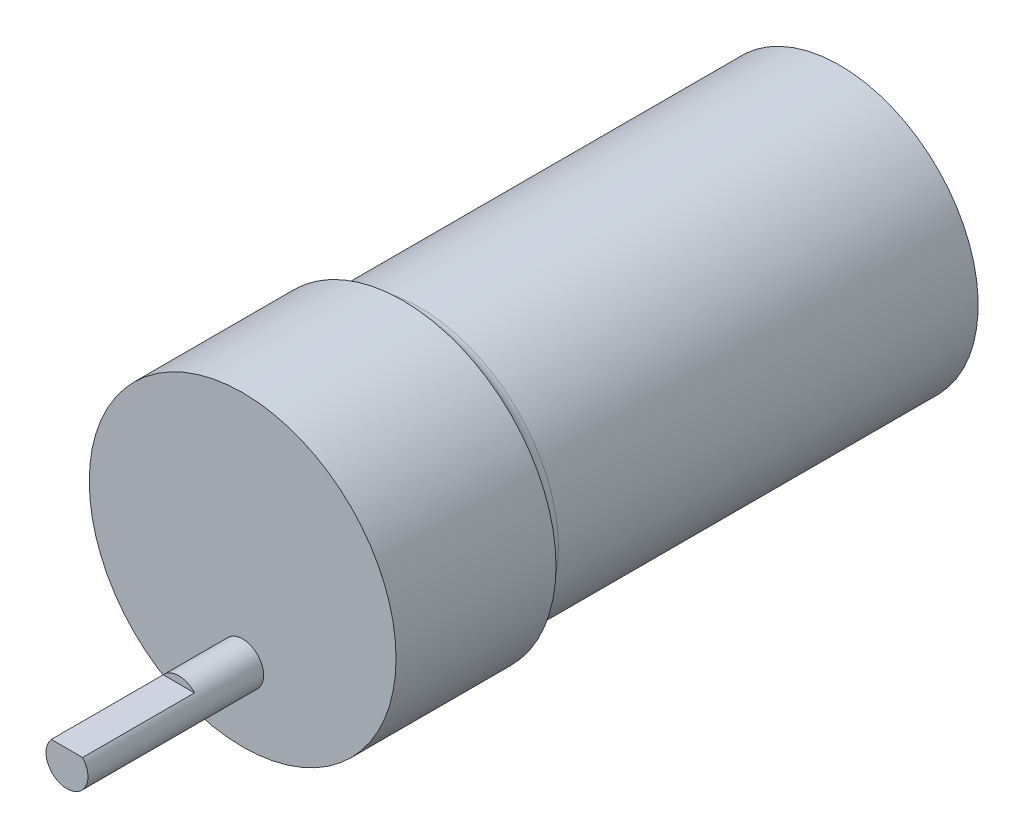
ISO-10303-21;
HEADER;
FILE_DESCRIPTION(('STEP AP214'),'2;1');
FILE_NAME('part.step','',(''),(''),'','','');
FILE_SCHEMA(('AUTOMOTIVE_DESIGN { 1 0 10303 214 1 1 1 1 }'));
ENDSEC;
DATA;
#1=APPLICATION_CONTEXT('core data for automotive mechanical design processes');
#2=APPLICATION_PROTOCOL_DEFINITION('international standard','automotive_design',2000,#1);
#3=PRODUCT_CONTEXT('',#1,'mechanical');
#4=PRODUCT('Part','Part','',(#3));
#5=PRODUCT_RELATED_PRODUCT_CATEGORY('part','',(#4));
#6=PRODUCT_DEFINITION_FORMATION('','',#4);
#7=PRODUCT_DEFINITION_CONTEXT('part definition',#1,'design');
#8=PRODUCT_DEFINITION('design','',#6,#7);
#9=PRODUCT_DEFINITION_SHAPE('','',#8);
#10=(LENGTH_UNIT() NAMED_UNIT(*) SI_UNIT(.MILLI.,.METRE.));
#11=(NAMED_UNIT(*) PLANE_ANGLE_UNIT() SI_UNIT($,.RADIAN.));
#12=(NAMED_UNIT(*) SI_UNIT($,.STERADIAN.) SOLID_ANGLE_UNIT());
#13=UNCERTAINTY_MEASURE_WITH_UNIT(LENGTH_MEASURE(1.E-05),#10,'distance_accuracy_value','');
#14=(GEOMETRIC_REPRESENTATION_CONTEXT(3) GLOBAL_UNCERTAINTY_ASSIGNED_CONTEXT((#13)) GLOBAL_UNIT_ASSIGNED_CONTEXT((#10,
#11,#12)) REPRESENTATION_CONTEXT('',''));
#15=CARTESIAN_POINT('',(0.,0.,0.));
#16=DIRECTION('',(0.,0.,1.));
#17=DIRECTION('',(1.,0.,0.));
#18=AXIS2_PLACEMENT_3D('',#15,#16,#17);
#19=CARTESIAN_POINT('',(0.,0.,68.3));
#20=DIRECTION('',(0.,0.,1.));
#21=DIRECTION('',(1.,0.,0.));
#22=AXIS2_PLACEMENT_3D('',#19,#20,#21);
#23=PLANE('',#22);
#24=CARTESIAN_POINT('',(0.,0.,68.3));
#25=DIRECTION('',(0.,0.,1.));
#26=DIRECTION('',(1.,0.,0.));
#27=AXIS2_PLACEMENT_3D('',#24,#25,#26);
#28=CIRCLE('',#27,17.55);
#29=CARTESIAN_POINT('',(17.55,0.,68.3));
#30=VERTEX_POINT('',#29);
#31=EDGE_CURVE('E65',#30,#30,#28,.T.);
#32=ORIENTED_EDGE('',*,*,#31,.T.);
#33=EDGE_LOOP('',(#32));
#34=FACE_BOUND('',#33,.T.);
#35=CARTESIAN_POINT('',(0.,-9.25,68.3));
#36=DIRECTION('',(0.,0.,1.));
#37=DIRECTION('',(1.,0.,0.));
#38=AXIS2_PLACEMENT_3D('',#35,#36,#37);
#39=CIRCLE('',#38,2.4);
#40=CARTESIAN_POINT('',(2.4,-9.25,68.3));
#41=VERTEX_POINT('',#40);
#42=EDGE_CURVE('E76',#41,#41,#39,.T.);
#43=ORIENTED_EDGE('',*,*,#42,.F.);
#44=EDGE_LOOP('',(#43));
#45=FACE_BOUND('',#44,.T.);
#46=ADVANCED_FACE('F34',(#34,#45),#23,.T.);
#47=CARTESIAN_POINT('',(0.,0.,68.3));
#48=DIRECTION('',(0.,0.,-1.));
#49=DIRECTION('',(-1.,0.,0.));
#50=AXIS2_PLACEMENT_3D('',#47,#48,#49);
#51=CYLINDRICAL_SURFACE('',#50,17.55);
#52=ORIENTED_EDGE('',*,*,#31,.F.);
#53=EDGE_LOOP('',(#52));
#54=FACE_BOUND('',#53,.T.);
#55=CARTESIAN_POINT('',(0.,0.,50.));
#56=DIRECTION('',(0.,0.,-1.));
#57=DIRECTION('',(-1.,0.,0.));
#58=AXIS2_PLACEMENT_3D('',#55,#56,#57);
#59=CIRCLE('',#58,17.55);
#60=CARTESIAN_POINT('',(-17.55,0.,50.));
#61=VERTEX_POINT('',#60);
#62=EDGE_CURVE('E79',#61,#61,#59,.T.);
#63=ORIENTED_EDGE('',*,*,#62,.F.);
#64=EDGE_LOOP('',(#63));
#65=FACE_BOUND('',#64,.T.);
#66=ADVANCED_FACE('F100',(#54,#65),#51,.T.);
#67=CARTESIAN_POINT('',(0.,0.,50.));
#68=DIRECTION('',(0.,0.,-1.));
#69=DIRECTION('',(-1.,0.,0.));
#70=AXIS2_PLACEMENT_3D('',#67,#68,#69);
#71=CYLINDRICAL_SURFACE('',#70,15.85);
#72=CARTESIAN_POINT('',(0.,0.,48.0226280066715));
#73=DIRECTION('',(0.,0.,1.));
#74=DIRECTION('',(1.,0.,0.));
#75=AXIS2_PLACEMENT_3D('',#72,#73,#74);
#76=CIRCLE('',#75,15.85);
#77=CARTESIAN_POINT('',(15.85,0.,48.0226280066715));
#78=VERTEX_POINT('',#77);
#79=EDGE_CURVE('E11',#78,#78,#76,.F.);
#80=ORIENTED_EDGE('',*,*,#79,.T.);
#81=EDGE_LOOP('',(#80));
#82=FACE_BOUND('',#81,.T.);
#83=CARTESIAN_POINT('',(0.,0.,0.));
#84=DIRECTION('',(0.,0.,-1.));
#85=DIRECTION('',(-1.,0.,0.));
#86=AXIS2_PLACEMENT_3D('',#83,#84,#85);
#87=CIRCLE('',#86,15.85);
#88=CARTESIAN_POINT('',(-15.85,0.,0.));
#89=VERTEX_POINT('',#88);
#90=EDGE_CURVE('E75',#89,#89,#87,.T.);
#91=ORIENTED_EDGE('',*,*,#90,.F.);
#92=EDGE_LOOP('',(#91));
#93=FACE_BOUND('',#92,.T.);
#94=ADVANCED_FACE('F108',(#82,#93),#71,.T.);
#95=CARTESIAN_POINT('',(0.,0.,0.));
#96=DIRECTION('',(0.,0.,1.));
#97=DIRECTION('',(1.,0.,0.));
#98=AXIS2_PLACEMENT_3D('',#95,#96,#97);
#99=PLANE('',#98);
#100=ORIENTED_EDGE('',*,*,#90,.T.);
#101=EDGE_LOOP('',(#100));
#102=FACE_BOUND('',#101,.T.);
#103=ADVANCED_FACE('F114',(#102),#99,.F.);
#104=CARTESIAN_POINT('',(0.,-9.25,88.4));
#105=DIRECTION('',(0.,0.,-1.));
#106=DIRECTION('',(-1.,0.,0.));
#107=AXIS2_PLACEMENT_3D('',#104,#105,#106);
#108=CYLINDRICAL_SURFACE('',#107,2.4);
#109=CARTESIAN_POINT('',(0.,-9.25,88.4));
#110=DIRECTION('',(0.,0.,1.));
#111=DIRECTION('',(1.,0.,0.));
#112=AXIS2_PLACEMENT_3D('',#109,#110,#111);
#113=CIRCLE('',#112,2.4);
#114=CARTESIAN_POINT('',(-1.78885438199983,-7.65,88.4));
#115=VERTEX_POINT('',#114);
#116=CARTESIAN_POINT('',(1.78885438199983,-7.65,88.4));
#117=VERTEX_POINT('',#116);
#118=EDGE_CURVE('E71',#115,#117,#113,.T.);
#119=ORIENTED_EDGE('',*,*,#118,.F.);
#120=DIRECTION('',(0.,0.,-1.));
#121=VECTOR('',#120,1.);
#122=CARTESIAN_POINT('',(-1.78885438199983,-7.65,88.4));
#123=LINE('',#122,#121);
#124=CARTESIAN_POINT('',(-1.78885438199983,-7.65,75.6));
#125=VERTEX_POINT('',#124);
#126=EDGE_CURVE('E49',#115,#125,#123,.T.);
#127=ORIENTED_EDGE('',*,*,#126,.T.);
#128=CARTESIAN_POINT('',(0.,-9.25,75.6));
#129=DIRECTION('',(0.,0.,1.));
#130=DIRECTION('',(1.,0.,0.));
#131=AXIS2_PLACEMENT_3D('',#128,#129,#130);
#132=CIRCLE('',#131,2.4);
#133=CARTESIAN_POINT('',(1.78885438199983,-7.65,75.6));
#134=VERTEX_POINT('',#133);
#135=EDGE_CURVE('E42',#134,#125,#132,.T.);
#136=ORIENTED_EDGE('',*,*,#135,.F.);
#137=DIRECTION('',(0.,0.,-1.));
#138=VECTOR('',#137,1.);
#139=CARTESIAN_POINT('',(1.78885438199983,-7.65,88.4));
#140=LINE('',#139,#138);
#141=EDGE_CURVE('E54',#134,#117,#140,.F.);
#142=ORIENTED_EDGE('',*,*,#141,.T.);
#143=EDGE_LOOP('',(#119,#127,#136,#142));
#144=FACE_BOUND('',#143,.T.);
#145=ORIENTED_EDGE('',*,*,#42,.T.);
#146=EDGE_LOOP('',(#145));
#147=FACE_BOUND('',#146,.T.);
#148=ADVANCED_FACE('F69',(#144,#147),#108,.T.);
#149=CARTESIAN_POINT('',(0.,-9.25,88.4));
#150=DIRECTION('',(0.,0.,1.));
#151=DIRECTION('',(1.,0.,0.));
#152=AXIS2_PLACEMENT_3D('',#149,#150,#151);
#153=PLANE('',#152);
#154=DIRECTION('',(1.,0.,0.));
#155=VECTOR('',#154,1.);
#156=CARTESIAN_POINT('',(0.,-7.65,88.4));
#157=LINE('',#156,#155);
#158=EDGE_CURVE('E60',#115,#117,#157,.T.);
#159=ORIENTED_EDGE('',*,*,#158,.F.);
#160=ORIENTED_EDGE('',*,*,#118,.T.);
#161=EDGE_LOOP('',(#159,#160));
#162=FACE_BOUND('',#161,.T.);
#163=ADVANCED_FACE('F74',(#162),#153,.T.);
#164=CARTESIAN_POINT('',(0.,0.,75.6));
#165=DIRECTION('',(0.,0.,1.));
#166=DIRECTION('',(1.,0.,0.));
#167=AXIS2_PLACEMENT_3D('',#164,#165,#166);
#168=PLANE('',#167);
#169=ORIENTED_EDGE('',*,*,#135,.T.);
#170=DIRECTION('',(1.,0.,0.));
#171=VECTOR('',#170,1.);
#172=CARTESIAN_POINT('',(-2.28348110091872,-7.65,75.6));
#173=LINE('',#172,#171);
#174=EDGE_CURVE('E72',#125,#134,#173,.T.);
#175=ORIENTED_EDGE('',*,*,#174,.T.);
#176=EDGE_LOOP('',(#169,#175));
#177=FACE_BOUND('',#176,.T.);
#178=ADVANCED_FACE('F89',(#177),#168,.T.);
#179=CARTESIAN_POINT('',(-2.28348110091872,-7.65,75.6));
#180=DIRECTION('',(0.,-1.,0.));
#181=DIRECTION('',(0.,0.,-1.));
#182=AXIS2_PLACEMENT_3D('',#179,#180,#181);
#183=PLANE('',#182);
#184=ORIENTED_EDGE('',*,*,#158,.T.);
#185=ORIENTED_EDGE('',*,*,#141,.F.);
#186=ORIENTED_EDGE('',*,*,#174,.F.);
#187=ORIENTED_EDGE('',*,*,#126,.F.);
#188=EDGE_LOOP('',(#184,#185,#186,#187));
#189=FACE_BOUND('',#188,.T.);
#190=ADVANCED_FACE('F61',(#189),#183,.F.);
#191=CARTESIAN_POINT('',(0.,0.,48.0226280066715));
#192=DIRECTION('',(0.,0.,1.));
#193=DIRECTION('',(1.,0.,0.));
#194=AXIS2_PLACEMENT_3D('',#191,#192,#193);
#195=TOROIDAL_SURFACE('',#194,17.85,2.);
#196=ORIENTED_EDGE('',*,*,#62,.T.);
#197=EDGE_LOOP('',(#196));
#198=FACE_BOUND('',#197,.T.);
#199=ORIENTED_EDGE('',*,*,#79,.F.);
#200=EDGE_LOOP('',(#199));
#201=FACE_BOUND('',#200,.T.);
#202=ADVANCED_FACE('F36',(#198,#201),#195,.F.);
#203=CLOSED_SHELL('',(#46,#66,#94,#103,#148,#163,#178,#190,#202));
#204=MANIFOLD_SOLID_BREP('B2',#203);
#205=ADVANCED_BREP_SHAPE_REPRESENTATION('',(#18,#204),#14);
#206=SHAPE_DEFINITION_REPRESENTATION(#9,#205);
ENDSEC;
END-ISO-10303-21;
